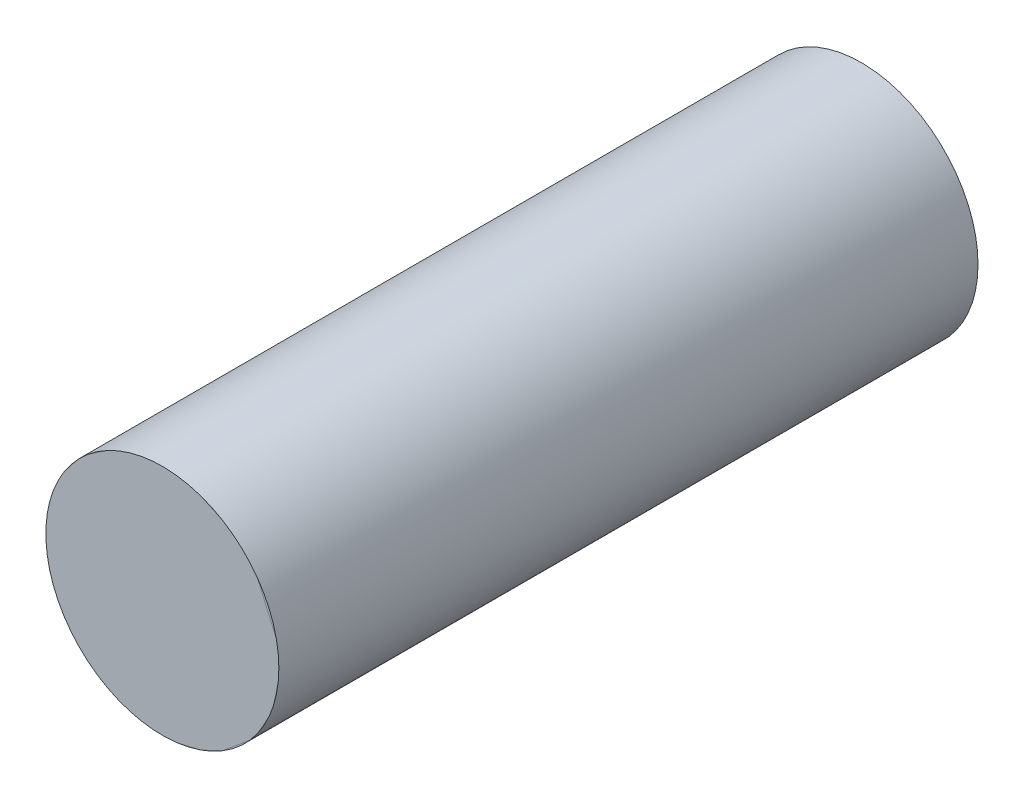
ISO-10303-21;
HEADER;
FILE_DESCRIPTION(('STEP AP214'),'2;1');
FILE_NAME('part.step','',(''),(''),'','','');
FILE_SCHEMA(('AUTOMOTIVE_DESIGN { 1 0 10303 214 1 1 1 1 }'));
ENDSEC;
DATA;
#1=APPLICATION_CONTEXT('core data for automotive mechanical design processes');
#2=APPLICATION_PROTOCOL_DEFINITION('international standard','automotive_design',2000,#1);
#3=PRODUCT_CONTEXT('',#1,'mechanical');
#4=PRODUCT('Part','Part','',(#3));
#5=PRODUCT_RELATED_PRODUCT_CATEGORY('part','',(#4));
#6=PRODUCT_DEFINITION_FORMATION('','',#4);
#7=PRODUCT_DEFINITION_CONTEXT('part definition',#1,'design');
#8=PRODUCT_DEFINITION('design','',#6,#7);
#9=PRODUCT_DEFINITION_SHAPE('','',#8);
#10=(LENGTH_UNIT() NAMED_UNIT(*) SI_UNIT(.MILLI.,.METRE.));
#11=(NAMED_UNIT(*) PLANE_ANGLE_UNIT() SI_UNIT($,.RADIAN.));
#12=(NAMED_UNIT(*) SI_UNIT($,.STERADIAN.) SOLID_ANGLE_UNIT());
#13=UNCERTAINTY_MEASURE_WITH_UNIT(LENGTH_MEASURE(1.E-05),#10,'distance_accuracy_value','');
#14=(GEOMETRIC_REPRESENTATION_CONTEXT(3) GLOBAL_UNCERTAINTY_ASSIGNED_CONTEXT((#13)) GLOBAL_UNIT_ASSIGNED_CONTEXT((#10,
#11,#12)) REPRESENTATION_CONTEXT('',''));
#15=CARTESIAN_POINT('',(0.,0.,0.));
#16=DIRECTION('',(0.,0.,1.));
#17=DIRECTION('',(1.,0.,0.));
#18=AXIS2_PLACEMENT_3D('',#15,#16,#17);
#19=CARTESIAN_POINT('',(-175.270710986926,-65.4180736437963,-9.79999999999999));
#20=DIRECTION('',(0.,0.,1.));
#21=DIRECTION('',(1.,0.,0.));
#22=AXIS2_PLACEMENT_3D('',#19,#20,#21);
#23=CYLINDRICAL_SURFACE('',#22,0.300000000000013);
#24=CARTESIAN_POINT('',(-175.270710986926,-65.4180736437963,-9.79999999999999));
#25=DIRECTION('',(0.,0.,1.));
#26=DIRECTION('',(1.,0.,0.));
#27=AXIS2_PLACEMENT_3D('',#24,#25,#26);
#28=CIRCLE('',#27,0.300000000000013);
#29=CARTESIAN_POINT('',(-174.970710986926,-65.4180736437963,-9.79999999999999));
#30=VERTEX_POINT('',#29);
#31=EDGE_CURVE('E11',#30,#30,#28,.T.);
#32=ORIENTED_EDGE('',*,*,#31,.T.);
#33=EDGE_LOOP('',(#32));
#34=FACE_BOUND('',#33,.T.);
#35=CARTESIAN_POINT('',(-175.270710986926,-65.4180736437963,-7.99999999999999));
#36=DIRECTION('',(0.,0.,1.));
#37=DIRECTION('',(1.,0.,0.));
#38=AXIS2_PLACEMENT_3D('',#35,#36,#37);
#39=CIRCLE('',#38,0.300000000000013);
#40=CARTESIAN_POINT('',(-174.970710986926,-65.4180736437963,-7.99999999999999));
#41=VERTEX_POINT('',#40);
#42=EDGE_CURVE('E46',#41,#41,#39,.T.);
#43=ORIENTED_EDGE('',*,*,#42,.F.);
#44=EDGE_LOOP('',(#43));
#45=FACE_BOUND('',#44,.T.);
#46=ADVANCED_FACE('F43',(#34,#45),#23,.T.);
#47=CARTESIAN_POINT('',(-175.270710986926,-65.4180736437963,-9.79999999999999));
#48=DIRECTION('',(0.,0.,1.));
#49=DIRECTION('',(1.,0.,0.));
#50=AXIS2_PLACEMENT_3D('',#47,#48,#49);
#51=PLANE('',#50);
#52=ORIENTED_EDGE('',*,*,#31,.F.);
#53=EDGE_LOOP('',(#52));
#54=FACE_BOUND('',#53,.T.);
#55=ADVANCED_FACE('F58',(#54),#51,.F.);
#56=CARTESIAN_POINT('',(-175.270710986926,-65.4180736437963,-7.99999999999999));
#57=DIRECTION('',(0.,0.,1.));
#58=DIRECTION('',(1.,0.,0.));
#59=AXIS2_PLACEMENT_3D('',#56,#57,#58);
#60=PLANE('',#59);
#61=ORIENTED_EDGE('',*,*,#42,.T.);
#62=EDGE_LOOP('',(#61));
#63=FACE_BOUND('',#62,.T.);
#64=ADVANCED_FACE('F55',(#63),#60,.T.);
#65=CLOSED_SHELL('',(#46,#55,#64));
#66=MANIFOLD_SOLID_BREP('B2',#65);
#67=CARTESIAN_POINT('',(-175.270710986926,-65.4180736437963,-7.99999999999999));
#68=DIRECTION('',(0.,0.,1.));
#69=DIRECTION('',(1.,0.,0.));
#70=AXIS2_PLACEMENT_3D('',#67,#68,#69);
#71=PLANE('',#70);
#72=CARTESIAN_POINT('',(-175.270710986926,-65.4180736437963,-7.99999999999999));
#73=DIRECTION('',(0.,0.,1.));
#74=DIRECTION('',(1.,0.,0.));
#75=AXIS2_PLACEMENT_3D('',#72,#73,#74);
#76=CIRCLE('',#75,0.300000000000022);
#77=CARTESIAN_POINT('',(-174.970710986926,-65.4180736437963,-7.99999999999999));
#78=VERTEX_POINT('',#77);
#79=EDGE_CURVE('E42',#78,#78,#76,.F.);
#80=ORIENTED_EDGE('',*,*,#79,.F.);
#81=EDGE_LOOP('',(#80));
#82=FACE_BOUND('',#81,.T.);
#83=ADVANCED_FACE('F83',(#82),#71,.T.);
#84=OPEN_SHELL('',(#83));
#85=SHELL_BASED_SURFACE_MODEL('B6',(#84));
#86=ADVANCED_BREP_SHAPE_REPRESENTATION('',(#18,#66),#14);
#87=MANIFOLD_SURFACE_SHAPE_REPRESENTATION('',(#18,#85),#14);
#88=SHAPE_REPRESENTATION('',(#18),#14);
#89=SHAPE_DEFINITION_REPRESENTATION(#9,#88);
#90=SHAPE_REPRESENTATION_RELATIONSHIP('','',#88,#86);
#91=SHAPE_REPRESENTATION_RELATIONSHIP('','',#88,#87);
ENDSEC;
END-ISO-10303-21;
